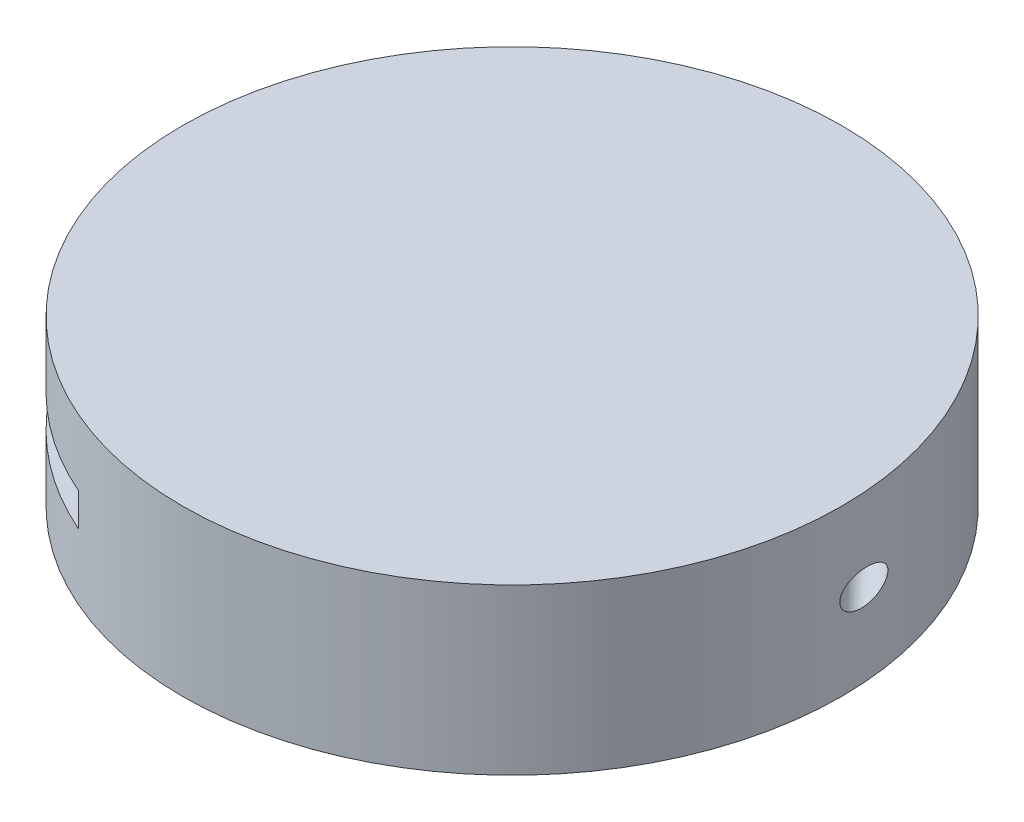
ISO-10303-21;
HEADER;
FILE_DESCRIPTION(('STEP AP214'),'2;1');
FILE_NAME('part.step','',(''),(''),'','','');
FILE_SCHEMA(('AUTOMOTIVE_DESIGN { 1 0 10303 214 1 1 1 1 }'));
ENDSEC;
DATA;
#1=APPLICATION_CONTEXT('core data for automotive mechanical design processes');
#2=APPLICATION_PROTOCOL_DEFINITION('international standard','automotive_design',2000,#1);
#3=PRODUCT_CONTEXT('',#1,'mechanical');
#4=PRODUCT('Part','Part','',(#3));
#5=PRODUCT_RELATED_PRODUCT_CATEGORY('part','',(#4));
#6=PRODUCT_DEFINITION_FORMATION('','',#4);
#7=PRODUCT_DEFINITION_CONTEXT('part definition',#1,'design');
#8=PRODUCT_DEFINITION('design','',#6,#7);
#9=PRODUCT_DEFINITION_SHAPE('','',#8);
#10=(LENGTH_UNIT() NAMED_UNIT(*) SI_UNIT(.MILLI.,.METRE.));
#11=(NAMED_UNIT(*) PLANE_ANGLE_UNIT() SI_UNIT($,.RADIAN.));
#12=(NAMED_UNIT(*) SI_UNIT($,.STERADIAN.) SOLID_ANGLE_UNIT());
#13=UNCERTAINTY_MEASURE_WITH_UNIT(LENGTH_MEASURE(1.E-05),#10,'distance_accuracy_value','');
#14=(GEOMETRIC_REPRESENTATION_CONTEXT(3) GLOBAL_UNCERTAINTY_ASSIGNED_CONTEXT((#13)) GLOBAL_UNIT_ASSIGNED_CONTEXT((#10,
#11,#12)) REPRESENTATION_CONTEXT('',''));
#15=CARTESIAN_POINT('',(0.,0.,0.));
#16=DIRECTION('',(0.,0.,1.));
#17=DIRECTION('',(1.,0.,0.));
#18=AXIS2_PLACEMENT_3D('',#15,#16,#17);
#19=CARTESIAN_POINT('',(-15.4709005410034,5.,-0.196257405736408));
#20=DIRECTION('',(0.192550687717084,0.,0.981287028682066));
#21=DIRECTION('',(0.981287028682066,0.,-0.192550687717084));
#22=AXIS2_PLACEMENT_3D('',#19,#20,#21);
#23=CYLINDRICAL_SURFACE('',#22,0.999999999999999);
#24=CARTESIAN_POINT('',(-15.43239040346,4.,0.));
#25=CARTESIAN_POINT('',(-15.4371712007441,3.99999976745943,0.000464581008555885));
#26=CARTESIAN_POINT('',(-15.4419530530917,4.00003408504249,0.000929265079981866));
#27=CARTESIAN_POINT('',(-15.5030193830045,4.00091272003534,0.00686348908024014));
#28=CARTESIAN_POINT('',(-15.5593633408726,4.00650008853509,0.0123388815193882));
#29=CARTESIAN_POINT('',(-15.6425351841717,4.02191906142388,0.0204214439335472));
#30=CARTESIAN_POINT('',(-15.6700777603542,4.02824737178271,0.0230980212325683));
#31=CARTESIAN_POINT('',(-15.7245614794708,4.04321672765971,0.0283927558199562));
#32=CARTESIAN_POINT('',(-15.7515021371671,4.05185957098412,0.0310108659741761));
#33=CARTESIAN_POINT('',(-15.8309903341894,4.08114326254573,0.0387356151624595));
#34=CARTESIAN_POINT('',(-15.8823464576918,4.10516580329628,0.043726507398875));
#35=CARTESIAN_POINT('',(-15.9802793509286,4.16154045244269,0.0532438932226854));
#36=CARTESIAN_POINT('',(-16.0268560146762,4.19389274549884,0.0577703765115981));
#37=CARTESIAN_POINT('',(-16.1138204931851,4.26594728767302,0.0662219348199739));
#38=CARTESIAN_POINT('',(-16.1542221273768,4.3056326722021,0.0701483527561489));
#39=CARTESIAN_POINT('',(-16.2277874317254,4.39128638254838,0.0772977970786232));
#40=CARTESIAN_POINT('',(-16.2609503478433,4.43725536210146,0.0805207501867697));
#41=CARTESIAN_POINT('',(-16.3189322882183,4.53394479226925,0.0861557654453824));
#42=CARTESIAN_POINT('',(-16.3437885133159,4.58464272171089,0.0885714429130465));
#43=CARTESIAN_POINT('',(-16.384635896769,4.68952257726802,0.0925412428676627));
#44=CARTESIAN_POINT('',(-16.4006274500688,4.74370434804921,0.0940954037374388));
#45=CARTESIAN_POINT('',(-16.4232300988705,4.85377617977086,0.0962920740757935));
#46=CARTESIAN_POINT('',(-16.4298793633608,4.9096583310622,0.09693829304473));
#47=CARTESIAN_POINT('',(-16.4337257772587,5.02174973186135,0.0973121126002295));
#48=CARTESIAN_POINT('',(-16.4309230565466,5.07795897686394,0.0970397258094248));
#49=CARTESIAN_POINT('',(-16.4159624272391,5.1889953743593,0.0955857550410436));
#50=CARTESIAN_POINT('',(-16.4038225230592,5.24382497725919,0.0944059208480979));
#51=CARTESIAN_POINT('',(-16.370562548728,5.35066226202183,0.0911735076909003));
#52=CARTESIAN_POINT('',(-16.3494423613693,5.4026699070434,0.0891209173357431));
#53=CARTESIAN_POINT('',(-16.2988052121054,5.50245423681234,0.0841996997820928));
#54=CARTESIAN_POINT('',(-16.2692787096169,5.55022603291186,0.0813301453862478));
#55=CARTESIAN_POINT('',(-16.2026901340079,5.64013097325074,0.0748587126776974));
#56=CARTESIAN_POINT('',(-16.1656285619606,5.68226449212007,0.0712568830604257));
#57=CARTESIAN_POINT('',(-16.0846939931178,5.76005207971962,0.0633912982848601));
#58=CARTESIAN_POINT('',(-16.0407661704477,5.79564848674675,0.0591222152348444));
#59=CARTESIAN_POINT('',(-15.9475600213478,5.8589354307652,0.050064130483504));
#60=CARTESIAN_POINT('',(-15.8982816372233,5.88662588249546,0.0452751231758722));
#61=CARTESIAN_POINT('',(-15.8214419681962,5.92164871116675,0.0378077016812417));
#62=CARTESIAN_POINT('',(-15.7953104389192,5.93224581827171,0.0352682019119004));
#63=CARTESIAN_POINT('',(-15.7422796601538,5.9511895192091,0.0301146189831382));
#64=CARTESIAN_POINT('',(-15.7153810881158,5.9595380348329,0.0275006016380926));
#65=CARTESIAN_POINT('',(-15.6338661241636,5.98109825960905,0.0195789766937145));
#66=CARTESIAN_POINT('',(-15.5782935849346,5.99088687406204,0.0141784920003707));
#67=CARTESIAN_POINT('',(-15.497214097484,5.99821827940226,0.00629936519228911));
#68=CARTESIAN_POINT('',(-15.4719811140239,5.99953518628247,0.00384729279394997));
#69=CARTESIAN_POINT('',(-15.4419540234149,5.99996565075822,0.000929359402708378));
#70=CARTESIAN_POINT('',(-15.4371722500046,5.99999994080979,0.000464682991696604));
#71=CARTESIAN_POINT('',(-15.43239040346,6.,0.));
#72=B_SPLINE_CURVE_WITH_KNOTS('',3,(#24,#25,#26,#27,#28,#29,#30,#31,#32,#33,#34,#35,#36,#37,#38,
#39,#40,#41,#42,#43,#44,#45,#46,#47,#48,#49,#50,#51,#52,#53,#54,#55,#56,#57,#58,#59,#60,#61,#62,
#63,#64,#65,#66,#67,#68,#69,#70,#71),.UNSPECIFIED.,.F.,.F.,(4,2,2,2,2,2,2,2,2,2,2,2,2,2,2,2,2,2,
2,2,2,2,2,4),(0.,0.0144128743197342,0.184042013393383,0.269127121439187,0.354278511738155,
0.524150482903644,0.694026220244487,0.86351603419933,1.03302349506259,1.20176132645818,
1.37049163953646,1.53853056094815,1.70656717333354,1.87428057910036,2.04199617387053,
2.20990287819946,2.37779842058166,2.54711039008855,2.71642418545598,2.80127369975428,
2.88605046439921,3.05515653494316,3.13125782323678,3.14567069755652),.UNSPECIFIED.);
#73=CARTESIAN_POINT('',(-15.43239040346,4.,0.));
#74=VERTEX_POINT('',#73);
#75=CARTESIAN_POINT('',(-16.4323908498638,5.00000000000001,0.0971823756618541));
#76=VERTEX_POINT('',#75);
#77=EDGE_CURVE('E243',#74,#76,#72,.T.);
#78=ORIENTED_EDGE('',*,*,#77,.T.);
#79=CARTESIAN_POINT('',(-15.4310110303126,5.,0.00702963460319863));
#80=DIRECTION('',(0.0896658743200073,0.,0.995971902707315));
#81=DIRECTION('',(0.995971902707315,0.,-0.0896658743200073));
#82=AXIS2_PLACEMENT_3D('',#79,#80,#81);
#83=ELLIPSE('',#82,1.00542978856048,0.999999999999999);
#84=CARTESIAN_POINT('',(-15.4310110303126,4.,0.00702963460319864));
#85=VERTEX_POINT('',#84);
#86=EDGE_CURVE('E228',#76,#85,#83,.T.);
#87=ORIENTED_EDGE('',*,*,#86,.T.);
#88=CARTESIAN_POINT('',(-15.4310110303126,6.,0.00702963460319863));
#89=VERTEX_POINT('',#88);
#90=EDGE_CURVE('E202',#85,#89,#83,.T.);
#91=ORIENTED_EDGE('',*,*,#90,.T.);
#92=EDGE_CURVE('E229',#89,#76,#83,.T.);
#93=ORIENTED_EDGE('',*,*,#92,.T.);
#94=CARTESIAN_POINT('',(-15.43239040346,6.,0.));
#95=VERTEX_POINT('',#94);
#96=EDGE_CURVE('E254',#76,#95,#72,.T.);
#97=ORIENTED_EDGE('',*,*,#96,.T.);
#98=CARTESIAN_POINT('',(-15.43239040346,4.,0.));
#99=CARTESIAN_POINT('',(-15.4276096061147,3.99999976750804,-0.000464582721420509));
#100=CARTESIAN_POINT('',(-15.422827743262,4.00003408508094,-0.000929158195556335));
#101=CARTESIAN_POINT('',(-15.3617500922791,4.00091287282075,-0.00686167062436035));
#102=CARTESIAN_POINT('',(-15.3053933543818,4.0065022043625,-0.0123203964732372));
#103=CARTESIAN_POINT('',(-15.2222007858327,4.02192573021389,-0.0203570148810716));
#104=CARTESIAN_POINT('',(-15.1946510063862,4.02825583889177,-0.0230147423828403));
#105=CARTESIAN_POINT('',(-15.1401524169916,4.04322918822343,-0.0282653905842816));
#106=CARTESIAN_POINT('',(-15.1132040918189,4.05187422661479,-0.03085825919714));
#107=CARTESIAN_POINT('',(-15.0336927147665,4.08116475605584,-0.0384988382493673));
#108=CARTESIAN_POINT('',(-14.9823204555366,4.10519227782216,-0.0434223114341478));
#109=CARTESIAN_POINT('',(-14.8843542043533,4.16157748262064,-0.0527900731221191));
#110=CARTESIAN_POINT('',(-14.8377603192045,4.19393535179315,-0.0572343509146121));
#111=CARTESIAN_POINT('',(-14.7507570460743,4.26600563477533,-0.0655166942077089));
#112=CARTESIAN_POINT('',(-14.7103344496084,4.30570192741698,-0.0693560550002529));
#113=CARTESIAN_POINT('',(-14.6367306562147,4.39138017983481,-0.0763356831665498));
#114=CARTESIAN_POINT('',(-14.6035502100506,4.43736279048476,-0.0794758780613428));
#115=CARTESIAN_POINT('',(-14.5455430952166,4.53407592188867,-0.0849589642290092));
#116=CARTESIAN_POINT('',(-14.5206781626879,4.58478328293956,-0.0873055080718791));
#117=CARTESIAN_POINT('',(-14.4798198324526,4.68968304176194,-0.0911583461329372));
#118=CARTESIAN_POINT('',(-14.4638260234903,4.74387527784851,-0.0926646793023778));
#119=CARTESIAN_POINT('',(-14.441230319818,4.85395237711171,-0.0947920958039035));
#120=CARTESIAN_POINT('',(-14.4345876029573,4.90982878871705,-0.0954170269156047));
#121=CARTESIAN_POINT('',(-14.4307577732933,5.02190720964705,-0.0957773783296741));
#122=CARTESIAN_POINT('',(-14.4335705152413,5.07810921395693,-0.0955128122959224));
#123=CARTESIAN_POINT('',(-14.4485527137478,5.18911978349665,-0.0941027417002622));
#124=CARTESIAN_POINT('',(-14.4607025610174,5.24393102064518,-0.0929590833598432));
#125=CARTESIAN_POINT('',(-14.493980698117,5.35073127769725,-0.0898233707072041));
#126=CARTESIAN_POINT('',(-14.5151091381321,5.40272025037634,-0.0878313022036215));
#127=CARTESIAN_POINT('',(-14.5657620810265,5.50247368162734,-0.0830486368131935));
#128=CARTESIAN_POINT('',(-14.5952970431286,5.55023277980756,-0.0802570451488665));
#129=CARTESIAN_POINT('',(-14.6618988420042,5.64011347583385,-0.0739505377414435));
#130=CARTESIAN_POINT('',(-14.6989650572361,5.6822355384195,-0.0704356816878383));
#131=CARTESIAN_POINT('',(-14.77972345744,5.75983036053947,-0.0627613922224341));
#132=CARTESIAN_POINT('',(-14.8234413264671,5.79527609909889,-0.0585994588245836));
#133=CARTESIAN_POINT('',(-14.9161814426384,5.85834183566145,-0.0497495056553639));
#134=CARTESIAN_POINT('',(-14.9652037779223,5.88596170360135,-0.0450614771422861));
#135=CARTESIAN_POINT('',(-15.0418573928546,5.92104466649547,-0.0377121980987739));
#136=CARTESIAN_POINT('',(-15.0680756268057,5.93172047293598,-0.0351954057411032));
#137=CARTESIAN_POINT('',(-15.1212880723444,5.95080613501979,-0.0300806678416154));
#138=CARTESIAN_POINT('',(-15.1482816070414,5.95921790453441,-0.0274827929283725));
#139=CARTESIAN_POINT('',(-15.2300906805132,5.98094300911362,-0.0195987953979723));
#140=CARTESIAN_POINT('',(-15.2858722186678,5.99080891361981,-0.0142091202507948));
#141=CARTESIAN_POINT('',(-15.3672974812437,5.99820425910146,-0.006319807883591));
#142=CARTESIAN_POINT('',(-15.3926651551283,5.99953326378799,-0.0038588788712697));
#143=CARTESIAN_POINT('',(-15.4228267739908,5.9999656505265,-0.000929250697832288));
#144=CARTESIAN_POINT('',(-15.4276085580882,5.99999994058257,-0.000464682685202067));
#145=CARTESIAN_POINT('',(-15.43239040346,6.,0.));
#146=B_SPLINE_CURVE_WITH_KNOTS('',3,(#98,#99,#100,#101,#102,#103,#104,#105,#106,#107,#108,#109,
#110,#111,#112,#113,#114,#115,#116,#117,#118,#119,#120,#121,#122,#123,#124,#125,#126,#127,#128,
#129,#130,#131,#132,#133,#134,#135,#136,#137,#138,#139,#140,#141,#142,#143,#144,#145),
.UNSPECIFIED.,.F.,.F.,(4,2,2,2,2,2,2,2,2,2,2,2,2,2,2,2,2,2,2,2,2,2,2,4),(0.,0.0144128743201625,
0.184075323980339,0.269177286883756,0.354345531253008,0.524249885037985,0.694158035639746,
0.863697271641482,1.03325407473597,1.20201956721872,1.37077723526651,1.53879588339746,
1.70681195054638,1.87447612040329,2.04214309489008,2.2100195959649,2.3778822480972,
2.54641033809832,2.71494122881285,2.80011195855081,2.88521046267395,3.05495772009452,
3.13146411288532,3.14587698720548),.UNSPECIFIED.);
#147=EDGE_CURVE('E242',#74,#95,#146,.T.);
#148=ORIENTED_EDGE('',*,*,#147,.F.);
#149=EDGE_LOOP('',(#78,#87,#91,#93,#97,#148));
#150=FACE_BOUND('',#149,.T.);
#151=ADVANCED_FACE('F72',(#150),#23,.F.);
#152=CARTESIAN_POINT('',(0.,10.,0.));
#153=DIRECTION('',(0.,-1.,0.));
#154=DIRECTION('',(0.,0.,-1.));
#155=AXIS2_PLACEMENT_3D('',#152,#153,#154);
#156=CYLINDRICAL_SURFACE('',#155,20.);
#157=CARTESIAN_POINT('',(0.,10.,0.));
#158=DIRECTION('',(0.,1.,0.));
#159=DIRECTION('',(0.,0.,1.));
#160=AXIS2_PLACEMENT_3D('',#157,#158,#159);
#161=CIRCLE('',#160,20.);
#162=CARTESIAN_POINT('',(0.,10.,20.));
#163=VERTEX_POINT('',#162);
#164=EDGE_CURVE('E354',#163,#163,#161,.T.);
#165=ORIENTED_EDGE('',*,*,#164,.F.);
#166=EDGE_LOOP('',(#165));
#167=FACE_BOUND('',#166,.T.);
#168=CARTESIAN_POINT('',(0.,0.,0.));
#169=DIRECTION('',(0.,1.,0.));
#170=DIRECTION('',(0.,0.,1.));
#171=AXIS2_PLACEMENT_3D('',#168,#169,#170);
#172=CIRCLE('',#171,20.);
#173=CARTESIAN_POINT('',(0.,0.,20.));
#174=VERTEX_POINT('',#173);
#175=EDGE_CURVE('E320',#174,#174,#172,.T.);
#176=ORIENTED_EDGE('',*,*,#175,.T.);
#177=EDGE_LOOP('',(#176));
#178=FACE_BOUND('',#177,.T.);
#179=CARTESIAN_POINT('',(19.9996644608909,5.,0.115850989546034));
#180=CARTESIAN_POINT('',(19.9996646705487,4.95624578744699,0.115845398326166));
#181=CARTESIAN_POINT('',(19.9996900619536,4.91244669692464,0.111664936008385));
#182=CARTESIAN_POINT('',(19.9997745792665,4.82635211257632,0.0952856549789294));
#183=CARTESIAN_POINT('',(19.9998337597725,4.78405917023907,0.0830738540192422));
#184=CARTESIAN_POINT('',(19.999939224392,4.70251258393055,0.0516899343315177));
#185=CARTESIAN_POINT('',(19.9999855946617,4.66323998466413,0.0325664165329392));
#186=CARTESIAN_POINT('',(20.0000088398909,4.58812871715236,-0.0114657464477621));
#187=CARTESIAN_POINT('',(19.9999856940858,4.55229107824059,-0.0363761181322695));
#188=CARTESIAN_POINT('',(19.9997763529892,4.47039045868836,-0.102019869546405));
#189=CARTESIAN_POINT('',(19.9995271126287,4.42617079230401,-0.145050505182721));
#190=CARTESIAN_POINT('',(19.9986424897453,4.34517117453742,-0.237609300172354));
#191=CARTESIAN_POINT('',(19.998006277234,4.308407441473,-0.287151245618692));
#192=CARTESIAN_POINT('',(19.9958632447147,4.22726161139211,-0.413487088567999));
#193=CARTESIAN_POINT('',(19.9940965952727,4.18663955434515,-0.492684051113804));
#194=CARTESIAN_POINT('',(19.9893967166805,4.1182494096185,-0.65634283619259));
#195=CARTESIAN_POINT('',(19.9864615184665,4.09050319015607,-0.740813341294598));
#196=CARTESIAN_POINT('',(19.9778652199971,4.03715119930383,-0.948515488313875));
#197=CARTESIAN_POINT('',(19.9715775945653,4.01728320607264,-1.07319636918882));
#198=CARTESIAN_POINT('',(19.9565262960417,3.99750286767381,-1.32399367177359));
#199=CARTESIAN_POINT('',(19.9477580284217,3.99762779720981,-1.4501123365327));
#200=CARTESIAN_POINT('',(19.9277019718537,4.01680072551759,-1.70388450767642));
#201=CARTESIAN_POINT('',(19.9163582731017,4.03630724352188,-1.83150113894347));
#202=CARTESIAN_POINT('',(19.8979250314423,4.08048240631837,-2.01904820562964));
#203=CARTESIAN_POINT('',(19.8915485543891,4.0976786846091,-2.08088190448146));
#204=CARTESIAN_POINT('',(19.8784164580438,4.13730458689188,-2.20279442860969));
#205=CARTESIAN_POINT('',(19.8716610706485,4.15973103594552,-2.2628742937417));
#206=CARTESIAN_POINT('',(19.8571081718711,4.21313124917619,-2.38738815181034));
#207=CARTESIAN_POINT('',(19.8492801818352,4.24479153426752,-2.45152783970282));
#208=CARTESIAN_POINT('',(19.8335977220436,4.3160074715358,-2.57532020801769));
#209=CARTESIAN_POINT('',(19.825743278173,4.35555685013574,-2.63497640224142));
#210=CARTESIAN_POINT('',(19.812361956193,4.4329584845944,-2.7335242536093));
#211=CARTESIAN_POINT('',(19.8067359269927,4.4688567772813,-2.77392436488973));
#212=CARTESIAN_POINT('',(19.796090993209,4.5464123804146,-2.84889521026055));
#213=CARTESIAN_POINT('',(19.7910708988696,4.58805804931467,-2.88347742222063));
#214=CARTESIAN_POINT('',(19.7834962110125,4.66377218872632,-2.93491742149147));
#215=CARTESIAN_POINT('',(19.7806555672969,4.69630983908814,-2.95397015282145));
#216=CARTESIAN_POINT('',(19.7757344570236,4.76404470576512,-2.98673756972343));
#217=CARTESIAN_POINT('',(19.7736532581912,4.79923932043304,-3.00045739824299));
#218=CARTESIAN_POINT('',(19.7704548302344,4.87197423574513,-3.02146219452844));
#219=CARTESIAN_POINT('',(19.7693475048168,4.90953456491779,-3.02868106881009));
#220=CARTESIAN_POINT('',(19.7682876958478,4.985354389835,-3.03559157804389));
#221=CARTESIAN_POINT('',(19.7683343180595,5.02361332123176,-3.03528904161601));
#222=CARTESIAN_POINT('',(19.7694844928636,5.09399791447014,-3.02778652198489));
#223=CARTESIAN_POINT('',(19.7704398400751,5.12623524818776,-3.02155368241418));
#224=CARTESIAN_POINT('',(19.7730975285965,5.18929299549577,-3.00411245275609));
#225=CARTESIAN_POINT('',(19.7748002773594,5.22011262607257,-2.99290134868122));
#226=CARTESIAN_POINT('',(19.7795531655906,5.29084150634102,-2.96135310521202));
#227=CARTESIAN_POINT('',(19.7828686486158,5.32990773699367,-2.93917493296717));
#228=CARTESIAN_POINT('',(19.7902678599003,5.40396189485639,-2.88893512893));
#229=CARTESIAN_POINT('',(19.7943532867187,5.43894052267949,-2.86086047303345));
#230=CARTESIAN_POINT('',(19.8053341689059,5.52280435437419,-2.78404989146583));
#231=CARTESIAN_POINT('',(19.8125512048919,5.56893214051861,-2.7323707526863));
#232=CARTESIAN_POINT('',(19.8273690062606,5.65282117287748,-2.62269467796434));
#233=CARTESIAN_POINT('',(19.8349706640658,5.69056175253802,-2.56468265010959));
#234=CARTESIAN_POINT('',(19.8487141902931,5.75231931076964,-2.4558036191253));
#235=CARTESIAN_POINT('',(19.8548629449723,5.77758277408469,-2.40563197939592));
#236=CARTESIAN_POINT('',(19.8669981230555,5.82370202355268,-2.30326951696597));
#237=CARTESIAN_POINT('',(19.8729844456912,5.84455512577737,-2.25107748747769));
#238=CARTESIAN_POINT('',(19.8905479425106,5.90100025663272,-2.09222595848241));
#239=CARTESIAN_POINT('',(19.901727280091,5.93046811419358,-1.98330952157933));
#240=CARTESIAN_POINT('',(19.923025703084,5.97539466194865,-1.75688897131287));
#241=CARTESIAN_POINT('',(19.9330634122015,5.9900759930088,-1.63922820806925));
#242=CARTESIAN_POINT('',(19.9510910910457,6.00276184542339,-1.40284667436342));
#243=CARTESIAN_POINT('',(19.9590819684691,6.00077377230255,-1.2841263980132));
#244=CARTESIAN_POINT('',(19.9720348481954,5.98019108245131,-1.06238262511154));
#245=CARTESIAN_POINT('',(19.9772454612684,5.96362118032924,-0.959187563960428));
#246=CARTESIAN_POINT('',(19.9859472338722,5.91494124519335,-0.756396833726596));
#247=CARTESIAN_POINT('',(19.9894409627959,5.88285457737765,-0.656795994005584));
#248=CARTESIAN_POINT('',(19.9939468676832,5.81413944143401,-0.496300198689361));
#249=CARTESIAN_POINT('',(19.9953964698879,5.78236980808458,-0.433339608570352));
#250=CARTESIAN_POINT('',(19.9976437952689,5.70979320460786,-0.312804098092703));
#251=CARTESIAN_POINT('',(19.9984424717246,5.66899956192926,-0.255221411710221));
#252=CARTESIAN_POINT('',(19.9993873803673,5.58908482548944,-0.161642657670373));
#253=CARTESIAN_POINT('',(19.9996466604682,5.5520844387044,-0.123844727453055));
#254=CARTESIAN_POINT('',(19.9999554551967,5.4725316543949,-0.0545665896010706));
#255=CARTESIAN_POINT('',(20.0000052019224,5.42998545382505,-0.0230794284406374));
#256=CARTESIAN_POINT('',(19.9999949685167,5.3483485198702,0.026390271597036));
#257=CARTESIAN_POINT('',(19.9999539592719,5.31012581773583,0.0458005985355958));
#258=CARTESIAN_POINT('',(19.9998544731755,5.2310091513577,0.0779952372614128));
#259=CARTESIAN_POINT('',(19.9997960321781,5.19012080348601,0.0907930037032842));
#260=CARTESIAN_POINT('',(19.9997243462182,5.12407905793943,0.105130389457675));
#261=CARTESIAN_POINT('',(19.9997024107147,5.09944210374355,0.109138199212017));
#262=CARTESIAN_POINT('',(19.9996724065965,5.04987500854986,0.1145004165105));
#263=CARTESIAN_POINT('',(19.9996643413624,5.02494479756396,0.115854177167057));
#264=CARTESIAN_POINT('',(19.9996644608909,5.,0.115850989546034));
#265=B_SPLINE_CURVE_WITH_KNOTS('',3,(#179,#180,#181,#182,#183,#184,#185,#186,#187,#188,#189,
#190,#191,#192,#193,#194,#195,#196,#197,#198,#199,#200,#201,#202,#203,#204,#205,#206,#207,#208,
#209,#210,#211,#212,#213,#214,#215,#216,#217,#218,#219,#220,#221,#222,#223,#224,#225,#226,#227,
#228,#229,#230,#231,#232,#233,#234,#235,#236,#237,#238,#239,#240,#241,#242,#243,#244,#245,#246,
#247,#248,#249,#250,#251,#252,#253,#254,#255,#256,#257,#258,#259,#260,#261,#262,#263,#264),
.UNSPECIFIED.,.T.,.F.,(4,2,2,2,2,2,2,2,2,2,2,2,2,2,2,2,2,2,2,2,2,2,2,2,2,2,2,2,2,2,2,2,2,2,2,2,
2,2,2,2,2,2,4),(0.,0.131150342454578,0.262513205510521,0.39296978766387,0.523465341515471,
0.707541604980935,0.892014079340261,1.1576146124512,1.42366460311315,1.80087244986666,
2.17878356919095,2.56585320517482,2.75915789141106,2.9523455374391,3.16775942546874,
3.38300268978683,3.54556242521561,3.70779759425913,3.82084553482568,3.93378418206031,
4.04785849207165,4.16184440442894,4.25994458982345,4.35809832202607,4.4924755017704,
4.62715267434151,4.83493311832078,5.04322000413059,5.21251633082522,5.38191538834621,
5.7207762720928,6.0766447518937,6.43235514247216,6.74531155292242,7.05779817304908,
7.26880546605547,7.47950318121481,7.63764768073251,7.7956169588768,7.92371351400629,
8.05154839289079,8.1263005472147,8.20107091907342),.UNSPECIFIED.);
#266=CARTESIAN_POINT('',(19.9996644608909,5.,0.115850989546034));
#267=VERTEX_POINT('',#266);
#268=EDGE_CURVE('E253',#267,#267,#265,.T.);
#269=ORIENTED_EDGE('',*,*,#268,.F.);
#270=EDGE_LOOP('',(#269));
#271=FACE_BOUND('',#270,.T.);
#272=DIRECTION('',(0.,-1.,0.));
#273=VECTOR('',#272,1.);
#274=CARTESIAN_POINT('',(-17.1199168011331,10.,10.3396541877512));
#275=LINE('',#274,#273);
#276=CARTESIAN_POINT('',(-17.1199168011331,6.,10.3396541877512));
#277=VERTEX_POINT('',#276);
#278=CARTESIAN_POINT('',(-17.1199168011331,4.,10.3396541877512));
#279=VERTEX_POINT('',#278);
#280=EDGE_CURVE('E230',#277,#279,#275,.T.);
#281=ORIENTED_EDGE('',*,*,#280,.F.);
#282=CARTESIAN_POINT('',(0.,6.,0.));
#283=DIRECTION('',(0.,1.,0.));
#284=DIRECTION('',(0.,0.,1.));
#285=AXIS2_PLACEMENT_3D('',#282,#283,#284);
#286=CIRCLE('',#285,20.);
#287=CARTESIAN_POINT('',(-7.96790416164542,6.,18.3442771258732));
#288=VERTEX_POINT('',#287);
#289=EDGE_CURVE('E235',#277,#288,#286,.T.);
#290=ORIENTED_EDGE('',*,*,#289,.T.);
#291=DIRECTION('',(0.,-1.,0.));
#292=VECTOR('',#291,1.);
#293=CARTESIAN_POINT('',(-7.96790416164543,10.,18.3442771258732));
#294=LINE('',#293,#292);
#295=CARTESIAN_POINT('',(-7.96790416164542,4.,18.3442771258732));
#296=VERTEX_POINT('',#295);
#297=EDGE_CURVE('E12',#296,#288,#294,.F.);
#298=ORIENTED_EDGE('',*,*,#297,.F.);
#299=CARTESIAN_POINT('',(0.,4.,0.));
#300=DIRECTION('',(0.,1.,0.));
#301=DIRECTION('',(0.,0.,1.));
#302=AXIS2_PLACEMENT_3D('',#299,#300,#301);
#303=CIRCLE('',#302,20.);
#304=EDGE_CURVE('E190',#279,#296,#303,.T.);
#305=ORIENTED_EDGE('',*,*,#304,.F.);
#306=EDGE_LOOP('',(#281,#290,#298,#305));
#307=FACE_BOUND('',#306,.T.);
#308=ADVANCED_FACE('F74',(#167,#178,#271,#307),#156,.T.);
#309=CARTESIAN_POINT('',(0.,0.,0.));
#310=DIRECTION('',(0.,1.,0.));
#311=DIRECTION('',(0.,0.,1.));
#312=AXIS2_PLACEMENT_3D('',#309,#310,#311);
#313=PLANE('',#312);
#314=ORIENTED_EDGE('',*,*,#175,.F.);
#315=EDGE_LOOP('',(#314));
#316=FACE_BOUND('',#315,.T.);
#317=DIRECTION('',(0.,0.,-1.));
#318=VECTOR('',#317,1.);
#319=CARTESIAN_POINT('',(2.15,0.,0.));
#320=LINE('',#319,#318);
#321=CARTESIAN_POINT('',(2.15,0.,1.5166375719581));
#322=VERTEX_POINT('',#321);
#323=CARTESIAN_POINT('',(2.15,0.,-4.08568408769113));
#324=VERTEX_POINT('',#323);
#325=EDGE_CURVE('E324',#322,#324,#320,.T.);
#326=ORIENTED_EDGE('',*,*,#325,.T.);
#327=CARTESIAN_POINT('',(0.,0.,-4.08568408769113));
#328=DIRECTION('',(0.,-1.,0.));
#329=DIRECTION('',(0.,0.,-1.));
#330=AXIS2_PLACEMENT_3D('',#327,#328,#329);
#331=CIRCLE('',#330,2.15);
#332=CARTESIAN_POINT('',(-2.15,0.,-4.08568408769113));
#333=VERTEX_POINT('',#332);
#334=EDGE_CURVE('E327',#333,#324,#331,.T.);
#335=ORIENTED_EDGE('',*,*,#334,.F.);
#336=DIRECTION('',(0.,0.,-1.));
#337=VECTOR('',#336,1.);
#338=CARTESIAN_POINT('',(-2.15,0.,0.));
#339=LINE('',#338,#337);
#340=CARTESIAN_POINT('',(-2.15,0.,1.5166375719581));
#341=VERTEX_POINT('',#340);
#342=EDGE_CURVE('E336',#341,#333,#339,.T.);
#343=ORIENTED_EDGE('',*,*,#342,.F.);
#344=CARTESIAN_POINT('',(0.,0.,4.08568408769113));
#345=DIRECTION('',(0.,-1.,0.));
#346=DIRECTION('',(0.,0.,-1.));
#347=AXIS2_PLACEMENT_3D('',#344,#345,#346);
#348=CIRCLE('',#347,3.35);
#349=EDGE_CURVE('E328',#322,#341,#348,.T.);
#350=ORIENTED_EDGE('',*,*,#349,.F.);
#351=EDGE_LOOP('',(#326,#335,#343,#350));
#352=FACE_BOUND('',#351,.T.);
#353=ADVANCED_FACE('F309',(#316,#352),#313,.F.);
#354=CARTESIAN_POINT('',(0.,10.,0.));
#355=DIRECTION('',(0.,1.,0.));
#356=DIRECTION('',(0.,0.,1.));
#357=AXIS2_PLACEMENT_3D('',#354,#355,#356);
#358=PLANE('',#357);
#359=ORIENTED_EDGE('',*,*,#164,.T.);
#360=EDGE_LOOP('',(#359));
#361=FACE_BOUND('',#360,.T.);
#362=ADVANCED_FACE('F298',(#361),#358,.T.);
#363=CARTESIAN_POINT('',(2.15,6.,0.));
#364=DIRECTION('',(-1.,0.,0.));
#365=DIRECTION('',(0.,0.,1.));
#366=AXIS2_PLACEMENT_3D('',#363,#364,#365);
#367=PLANE('',#366);
#368=DIRECTION('',(0.,0.,1.));
#369=VECTOR('',#368,1.);
#370=CARTESIAN_POINT('',(2.15,2.,0.));
#371=LINE('',#370,#369);
#372=CARTESIAN_POINT('',(2.15,2.,-4.08568408769113));
#373=VERTEX_POINT('',#372);
#374=CARTESIAN_POINT('',(2.15,2.,1.5166375719581));
#375=VERTEX_POINT('',#374);
#376=EDGE_CURVE('E348',#373,#375,#371,.T.);
#377=ORIENTED_EDGE('',*,*,#376,.F.);
#378=DIRECTION('',(0.,-1.,0.));
#379=VECTOR('',#378,1.);
#380=CARTESIAN_POINT('',(2.15,6.,-4.08568408769113));
#381=LINE('',#380,#379);
#382=EDGE_CURVE('E334',#373,#324,#381,.T.);
#383=ORIENTED_EDGE('',*,*,#382,.T.);
#384=ORIENTED_EDGE('',*,*,#325,.F.);
#385=DIRECTION('',(0.,-1.,0.));
#386=VECTOR('',#385,1.);
#387=CARTESIAN_POINT('',(2.15,6.,1.5166375719581));
#388=LINE('',#387,#386);
#389=EDGE_CURVE('E97',#375,#322,#388,.T.);
#390=ORIENTED_EDGE('',*,*,#389,.F.);
#391=EDGE_LOOP('',(#377,#383,#384,#390));
#392=FACE_BOUND('',#391,.T.);
#393=ADVANCED_FACE('F294',(#392),#367,.T.);
#394=CARTESIAN_POINT('',(0.,6.,-4.08568408769113));
#395=DIRECTION('',(0.,-1.,0.));
#396=DIRECTION('',(0.,0.,-1.));
#397=AXIS2_PLACEMENT_3D('',#394,#395,#396);
#398=CYLINDRICAL_SURFACE('',#397,2.15);
#399=ORIENTED_EDGE('',*,*,#382,.F.);
#400=CARTESIAN_POINT('',(0.,2.,-4.08568408769113));
#401=DIRECTION('',(0.,-1.,0.));
#402=DIRECTION('',(0.,0.,-1.));
#403=AXIS2_PLACEMENT_3D('',#400,#401,#402);
#404=CIRCLE('',#403,2.15);
#405=CARTESIAN_POINT('',(-2.15,2.,-4.08568408769113));
#406=VERTEX_POINT('',#405);
#407=EDGE_CURVE('E592',#373,#406,#404,.F.);
#408=ORIENTED_EDGE('',*,*,#407,.T.);
#409=DIRECTION('',(0.,-1.,0.));
#410=VECTOR('',#409,1.);
#411=CARTESIAN_POINT('',(-2.15,6.,-4.08568408769113));
#412=LINE('',#411,#410);
#413=EDGE_CURVE('E330',#406,#333,#412,.T.);
#414=ORIENTED_EDGE('',*,*,#413,.T.);
#415=ORIENTED_EDGE('',*,*,#334,.T.);
#416=EDGE_LOOP('',(#399,#408,#414,#415));
#417=FACE_BOUND('',#416,.T.);
#418=ADVANCED_FACE('F297',(#417),#398,.F.);
#419=CARTESIAN_POINT('',(-2.15,6.,0.));
#420=DIRECTION('',(-1.,0.,0.));
#421=DIRECTION('',(0.,0.,1.));
#422=AXIS2_PLACEMENT_3D('',#419,#420,#421);
#423=PLANE('',#422);
#424=ORIENTED_EDGE('',*,*,#413,.F.);
#425=DIRECTION('',(0.,0.,1.));
#426=VECTOR('',#425,1.);
#427=CARTESIAN_POINT('',(-2.15,2.,0.));
#428=LINE('',#427,#426);
#429=CARTESIAN_POINT('',(-2.15,2.,1.5166375719581));
#430=VERTEX_POINT('',#429);
#431=EDGE_CURVE('E588',#406,#430,#428,.T.);
#432=ORIENTED_EDGE('',*,*,#431,.T.);
#433=DIRECTION('',(0.,-1.,0.));
#434=VECTOR('',#433,1.);
#435=CARTESIAN_POINT('',(-2.15,6.,1.5166375719581));
#436=LINE('',#435,#434);
#437=EDGE_CURVE('E351',#430,#341,#436,.T.);
#438=ORIENTED_EDGE('',*,*,#437,.T.);
#439=ORIENTED_EDGE('',*,*,#342,.T.);
#440=EDGE_LOOP('',(#424,#432,#438,#439));
#441=FACE_BOUND('',#440,.T.);
#442=ADVANCED_FACE('F292',(#441),#423,.F.);
#443=CARTESIAN_POINT('',(0.,6.,0.));
#444=DIRECTION('',(0.,-1.,0.));
#445=DIRECTION('',(0.,0.,-1.));
#446=AXIS2_PLACEMENT_3D('',#443,#444,#445);
#447=PLANE('',#446);
#448=DIRECTION('',(0.,0.,1.));
#449=VECTOR('',#448,1.);
#450=CARTESIAN_POINT('',(3.35,6.,-4.08568408769113));
#451=LINE('',#450,#449);
#452=CARTESIAN_POINT('',(3.35,6.,-4.08568408769113));
#453=VERTEX_POINT('',#452);
#454=CARTESIAN_POINT('',(3.35,6.,4.08568408769113));
#455=VERTEX_POINT('',#454);
#456=EDGE_CURVE('E556',#453,#455,#451,.T.);
#457=ORIENTED_EDGE('',*,*,#456,.T.);
#458=CARTESIAN_POINT('',(0.,6.,4.08568408769113));
#459=DIRECTION('',(0.,-1.,0.));
#460=DIRECTION('',(0.,0.,-1.));
#461=AXIS2_PLACEMENT_3D('',#458,#459,#460);
#462=CIRCLE('',#461,3.35);
#463=CARTESIAN_POINT('',(-3.35,6.,4.08568408769113));
#464=VERTEX_POINT('',#463);
#465=EDGE_CURVE('E342',#455,#464,#462,.T.);
#466=ORIENTED_EDGE('',*,*,#465,.T.);
#467=DIRECTION('',(0.,0.,-1.));
#468=VECTOR('',#467,1.);
#469=CARTESIAN_POINT('',(-3.35,6.,-4.08568408769113));
#470=LINE('',#469,#468);
#471=CARTESIAN_POINT('',(-3.35,6.,-4.08568408769113));
#472=VERTEX_POINT('',#471);
#473=EDGE_CURVE('E559',#464,#472,#470,.T.);
#474=ORIENTED_EDGE('',*,*,#473,.T.);
#475=CARTESIAN_POINT('',(0.,6.,-4.08568408769113));
#476=DIRECTION('',(0.,-1.,0.));
#477=DIRECTION('',(0.,0.,-1.));
#478=AXIS2_PLACEMENT_3D('',#475,#476,#477);
#479=CIRCLE('',#478,3.35);
#480=EDGE_CURVE('E368',#472,#453,#479,.T.);
#481=ORIENTED_EDGE('',*,*,#480,.T.);
#482=EDGE_LOOP('',(#457,#466,#474,#481));
#483=FACE_BOUND('',#482,.T.);
#484=ADVANCED_FACE('F289',(#483),#447,.T.);
#485=CARTESIAN_POINT('',(0.,6.,4.08568408769113));
#486=DIRECTION('',(0.,-1.,0.));
#487=DIRECTION('',(0.,0.,-1.));
#488=AXIS2_PLACEMENT_3D('',#485,#486,#487);
#489=CYLINDRICAL_SURFACE('',#488,3.35);
#490=CARTESIAN_POINT('',(0.,2.,4.08568408769113));
#491=DIRECTION('',(0.,-1.,0.));
#492=DIRECTION('',(0.,0.,-1.));
#493=AXIS2_PLACEMENT_3D('',#490,#491,#492);
#494=CIRCLE('',#493,3.35);
#495=CARTESIAN_POINT('',(-3.35,2.,4.08568408769113));
#496=VERTEX_POINT('',#495);
#497=EDGE_CURVE('E358',#430,#496,#494,.F.);
#498=ORIENTED_EDGE('',*,*,#497,.T.);
#499=DIRECTION('',(0.,1.,0.));
#500=VECTOR('',#499,1.);
#501=CARTESIAN_POINT('',(-3.35,2.,4.08568408769113));
#502=LINE('',#501,#500);
#503=EDGE_CURVE('E576',#496,#464,#502,.T.);
#504=ORIENTED_EDGE('',*,*,#503,.T.);
#505=ORIENTED_EDGE('',*,*,#465,.F.);
#506=DIRECTION('',(0.,1.,0.));
#507=VECTOR('',#506,1.);
#508=CARTESIAN_POINT('',(3.35,2.,4.08568408769113));
#509=LINE('',#508,#507);
#510=CARTESIAN_POINT('',(3.35,2.,4.08568408769113));
#511=VERTEX_POINT('',#510);
#512=EDGE_CURVE('E580',#511,#455,#509,.T.);
#513=ORIENTED_EDGE('',*,*,#512,.F.);
#514=EDGE_CURVE('E82',#511,#375,#494,.F.);
#515=ORIENTED_EDGE('',*,*,#514,.T.);
#516=ORIENTED_EDGE('',*,*,#389,.T.);
#517=ORIENTED_EDGE('',*,*,#349,.T.);
#518=ORIENTED_EDGE('',*,*,#437,.F.);
#519=EDGE_LOOP('',(#498,#504,#505,#513,#515,#516,#517,#518));
#520=FACE_BOUND('',#519,.T.);
#521=ADVANCED_FACE('F275',(#520),#489,.F.);
#522=CARTESIAN_POINT('',(0.,2.,-4.08568408769113));
#523=DIRECTION('',(0.,-1.,0.));
#524=DIRECTION('',(0.,0.,-1.));
#525=AXIS2_PLACEMENT_3D('',#522,#523,#524);
#526=PLANE('',#525);
#527=DIRECTION('',(0.,0.,1.));
#528=VECTOR('',#527,1.);
#529=CARTESIAN_POINT('',(3.35,2.,-4.08568408769113));
#530=LINE('',#529,#528);
#531=CARTESIAN_POINT('',(3.35,2.,-4.08568408769113));
#532=VERTEX_POINT('',#531);
#533=EDGE_CURVE('E566',#532,#511,#530,.T.);
#534=ORIENTED_EDGE('',*,*,#533,.F.);
#535=CARTESIAN_POINT('',(0.,2.,-4.08568408769113));
#536=DIRECTION('',(0.,-1.,0.));
#537=DIRECTION('',(0.,0.,-1.));
#538=AXIS2_PLACEMENT_3D('',#535,#536,#537);
#539=CIRCLE('',#538,3.35);
#540=CARTESIAN_POINT('',(-3.35,2.,-4.08568408769113));
#541=VERTEX_POINT('',#540);
#542=EDGE_CURVE('E562',#541,#532,#539,.T.);
#543=ORIENTED_EDGE('',*,*,#542,.F.);
#544=DIRECTION('',(0.,0.,-1.));
#545=VECTOR('',#544,1.);
#546=CARTESIAN_POINT('',(-3.35,2.,-4.08568408769113));
#547=LINE('',#546,#545);
#548=EDGE_CURVE('E569',#496,#541,#547,.T.);
#549=ORIENTED_EDGE('',*,*,#548,.F.);
#550=ORIENTED_EDGE('',*,*,#497,.F.);
#551=ORIENTED_EDGE('',*,*,#431,.F.);
#552=ORIENTED_EDGE('',*,*,#407,.F.);
#553=ORIENTED_EDGE('',*,*,#376,.T.);
#554=ORIENTED_EDGE('',*,*,#514,.F.);
#555=EDGE_LOOP('',(#534,#543,#549,#550,#551,#552,#553,#554));
#556=FACE_BOUND('',#555,.T.);
#557=ADVANCED_FACE('F271',(#556),#526,.F.);
#558=CARTESIAN_POINT('',(0.,2.,-4.08568408769113));
#559=DIRECTION('',(0.,1.,0.));
#560=DIRECTION('',(0.,0.,1.));
#561=AXIS2_PLACEMENT_3D('',#558,#559,#560);
#562=CYLINDRICAL_SURFACE('',#561,3.35);
#563=ORIENTED_EDGE('',*,*,#480,.F.);
#564=DIRECTION('',(0.,1.,0.));
#565=VECTOR('',#564,1.);
#566=CARTESIAN_POINT('',(-3.35,2.,-4.08568408769113));
#567=LINE('',#566,#565);
#568=EDGE_CURVE('E572',#541,#472,#567,.T.);
#569=ORIENTED_EDGE('',*,*,#568,.F.);
#570=ORIENTED_EDGE('',*,*,#542,.T.);
#571=DIRECTION('',(0.,1.,0.));
#572=VECTOR('',#571,1.);
#573=CARTESIAN_POINT('',(3.35,2.,-4.08568408769113));
#574=LINE('',#573,#572);
#575=EDGE_CURVE('E584',#532,#453,#574,.T.);
#576=ORIENTED_EDGE('',*,*,#575,.T.);
#577=EDGE_LOOP('',(#563,#569,#570,#576));
#578=FACE_BOUND('',#577,.T.);
#579=ADVANCED_FACE('F274',(#578),#562,.F.);
#580=CARTESIAN_POINT('',(3.35,2.,-4.08568408769113));
#581=DIRECTION('',(-1.,0.,0.));
#582=DIRECTION('',(0.,0.,1.));
#583=AXIS2_PLACEMENT_3D('',#580,#581,#582);
#584=PLANE('',#583);
#585=ORIENTED_EDGE('',*,*,#456,.F.);
#586=ORIENTED_EDGE('',*,*,#575,.F.);
#587=ORIENTED_EDGE('',*,*,#533,.T.);
#588=ORIENTED_EDGE('',*,*,#512,.T.);
#589=EDGE_LOOP('',(#585,#586,#587,#588));
#590=FACE_BOUND('',#589,.T.);
#591=ADVANCED_FACE('F281',(#590),#584,.T.);
#592=CARTESIAN_POINT('',(-3.35,2.,-4.08568408769113));
#593=DIRECTION('',(1.,0.,0.));
#594=DIRECTION('',(0.,0.,-1.));
#595=AXIS2_PLACEMENT_3D('',#592,#593,#594);
#596=PLANE('',#595);
#597=ORIENTED_EDGE('',*,*,#473,.F.);
#598=ORIENTED_EDGE('',*,*,#503,.F.);
#599=ORIENTED_EDGE('',*,*,#548,.T.);
#600=ORIENTED_EDGE('',*,*,#568,.T.);
#601=EDGE_LOOP('',(#597,#598,#599,#600));
#602=FACE_BOUND('',#601,.T.);
#603=ADVANCED_FACE('F277',(#602),#596,.T.);
#604=CARTESIAN_POINT('',(50.8724650324793,5.,31.2187433023384));
#605=DIRECTION('',(-0.6880982415987,0.,-0.7256175369358));
#606=DIRECTION('',(-0.7256175369358,0.,0.6880982415987));
#607=AXIS2_PLACEMENT_3D('',#604,#605,#606);
#608=CYLINDRICAL_SURFACE('',#607,0.999999999999999);
#609=CARTESIAN_POINT('',(11.1980131135903,5.,-10.6190007002855));
#610=DIRECTION('',(0.6880982415987,0.,0.7256175369358));
#611=DIRECTION('',(0.7256175369358,0.,-0.6880982415987));
#612=AXIS2_PLACEMENT_3D('',#609,#610,#611);
#613=CIRCLE('',#612,0.999999999999999);
#614=CARTESIAN_POINT('',(11.9236306505261,5.,-11.3070989418842));
#615=VERTEX_POINT('',#614);
#616=EDGE_CURVE('E238',#615,#615,#613,.T.);
#617=ORIENTED_EDGE('',*,*,#616,.F.);
#618=EDGE_LOOP('',(#617));
#619=FACE_BOUND('',#618,.T.);
#620=ORIENTED_EDGE('',*,*,#268,.T.);
#621=EDGE_LOOP('',(#620));
#622=FACE_BOUND('',#621,.T.);
#623=ADVANCED_FACE('F280',(#619,#622),#608,.F.);
#624=CARTESIAN_POINT('',(11.9236306505261,5.,-11.3070989418842));
#625=CARTESIAN_POINT('',(9.67848578067433,5.,-13.6746627460596));
#626=CARTESIAN_POINT('',(6.71269586530027,5.,-15.349566692705));
#627=CARTESIAN_POINT('',(0.339033785582667,5.,-16.7497623722109));
#628=CARTESIAN_POINT('',(-3.05569120835315,5.,-16.4721654518497));
#629=CARTESIAN_POINT('',(-9.1172049544848,5.,-14.0551078704707));
#630=CARTESIAN_POINT('',(-11.7714909737107,5.,-11.9206326503321));
#631=CARTESIAN_POINT('',(-14.5175174530028,5.,-7.8693486651144));
#632=CARTESIAN_POINT('',(-15.2297248319933,5.,-6.38283022625424));
#633=CARTESIAN_POINT('',(-15.948016599779,5.,-4.04346600713315));
#634=CARTESIAN_POINT('',(-16.129290068848,5.,-3.24576413936124));
#635=CARTESIAN_POINT('',(-16.3109193474687,5.,-2.03561945424736));
#636=CARTESIAN_POINT('',(-16.3564387583881,5.,-1.62997274564356));
#637=CARTESIAN_POINT('',(-16.4171734753416,5.,-0.816281255888751));
#638=CARTESIAN_POINT('',(-16.4323837901338,5.,-0.395816267210033));
#639=CARTESIAN_POINT('',(-16.4323915534198,5.,0.068826610603157));
#640=CARTESIAN_POINT('',(-16.43239040346,5.,0.133333333333631));
#641=CARTESIAN_POINT('',(-16.43239040346,5.,0.200000000000006));
#642=CARTESIAN_POINT('',(11.9236306505261,7.,-11.3070989418842));
#643=CARTESIAN_POINT('',(9.67848578067433,7.,-13.6746627460596));
#644=CARTESIAN_POINT('',(6.71269586530027,7.,-15.349566692705));
#645=CARTESIAN_POINT('',(0.339033785582669,7.,-16.7497623722109));
#646=CARTESIAN_POINT('',(-3.05569120835315,7.,-16.4721654518497));
#647=CARTESIAN_POINT('',(-9.1172049544848,7.,-14.0551078704707));
#648=CARTESIAN_POINT('',(-11.7714909737107,7.,-11.9206326503321));
#649=CARTESIAN_POINT('',(-14.5175174530028,7.,-7.8693486651144));
#650=CARTESIAN_POINT('',(-15.2297248319933,7.,-6.38283022625424));
#651=CARTESIAN_POINT('',(-15.948016599779,7.,-4.04346600713315));
#652=CARTESIAN_POINT('',(-16.129290068848,7.,-3.24576413936124));
#653=CARTESIAN_POINT('',(-16.3109193474687,7.,-2.03561945424736));
#654=CARTESIAN_POINT('',(-16.3564387583881,7.,-1.62997274564356));
#655=CARTESIAN_POINT('',(-16.4171734753416,7.,-0.816281255888751));
#656=CARTESIAN_POINT('',(-16.4323837901338,7.,-0.395816267210033));
#657=CARTESIAN_POINT('',(-16.4323915534198,7.,0.068826610603157));
#658=CARTESIAN_POINT('',(-16.43239040346,7.,0.133333333333631));
#659=CARTESIAN_POINT('',(-16.43239040346,7.,0.200000000000006));
#660=CARTESIAN_POINT('',(10.4723955766545,7.,-9.93090245868679));
#661=CARTESIAN_POINT('',(8.50050916947642,7.,-12.0103080891523));
#662=CARTESIAN_POINT('',(5.89568802890535,7.,-13.4813580735284));
#663=CARTESIAN_POINT('',(0.297769699543412,7.,-14.7111347640596));
#664=CARTESIAN_POINT('',(-2.6837804718911,7.,-14.4673243973952));
#665=CARTESIAN_POINT('',(-8.00754230278362,7.,-12.344448918804));
#666=CARTESIAN_POINT('',(-10.3387729473471,7.,-10.4697624655923));
#667=CARTESIAN_POINT('',(-12.7505782437225,7.,-6.91156364760076));
#668=CARTESIAN_POINT('',(-13.3761022660721,7.,-5.60597061306915));
#669=CARTESIAN_POINT('',(-14.0069701411399,7.,-3.55133237254346));
#670=CARTESIAN_POINT('',(-14.1661806644551,7.,-2.85071946725894));
#671=CARTESIAN_POINT('',(-14.3257036914389,7.,-1.78786250541031));
#672=CARTESIAN_POINT('',(-14.3656828967275,7.,-1.43158739749019));
#673=CARTESIAN_POINT('',(-14.4190255404093,7.,-0.716930980499766));
#674=CARTESIAN_POINT('',(-14.4323845950473,7.,-0.370972777006924));
#675=CARTESIAN_POINT('',(-14.4323914134573,7.,0.0645066940967316));
#676=CARTESIAN_POINT('',(-14.43239040346,7.,0.133333333333631));
#677=CARTESIAN_POINT('',(-14.43239040346,7.,0.200000000000006));
#678=CARTESIAN_POINT('',(10.4723955766545,5.,-9.93090245868679));
#679=CARTESIAN_POINT('',(8.50050916947642,5.,-12.0103080891523));
#680=CARTESIAN_POINT('',(5.89568802889472,5.,-13.4813580735284));
#681=CARTESIAN_POINT('',(0.297769699554043,5.,-14.7111347640596));
#682=CARTESIAN_POINT('',(-2.6837804718911,5.,-14.4673243973952));
#683=CARTESIAN_POINT('',(-8.00754230278362,5.,-12.344448918804));
#684=CARTESIAN_POINT('',(-10.3387729473471,5.,-10.4697624655923));
#685=CARTESIAN_POINT('',(-12.7505782437225,5.,-6.91156364760076));
#686=CARTESIAN_POINT('',(-13.3761022660721,5.,-5.60597061306915));
#687=CARTESIAN_POINT('',(-14.0069701411399,5.,-3.55133237254346));
#688=CARTESIAN_POINT('',(-14.1661806644551,5.,-2.85071946725894));
#689=CARTESIAN_POINT('',(-14.3257036914389,5.,-1.78786250541031));
#690=CARTESIAN_POINT('',(-14.3656828967275,5.,-1.43158739749019));
#691=CARTESIAN_POINT('',(-14.4190255404093,5.,-0.716930980499766));
#692=CARTESIAN_POINT('',(-14.4323845950473,5.,-0.370972777006924));
#693=CARTESIAN_POINT('',(-14.4323914134573,5.,0.0645066940967316));
#694=CARTESIAN_POINT('',(-14.43239040346,5.,0.133333333333631));
#695=CARTESIAN_POINT('',(-14.43239040346,5.,0.200000000000006));
#696=CARTESIAN_POINT('',(10.4723955766545,3.,-9.93090245868679));
#697=CARTESIAN_POINT('',(8.50050916947642,3.,-12.0103080891523));
#698=CARTESIAN_POINT('',(5.89568802888409,3.,-13.4813580735284));
#699=CARTESIAN_POINT('',(0.297769699564675,3.,-14.7111347640596));
#700=CARTESIAN_POINT('',(-2.6837804718911,3.,-14.4673243973952));
#701=CARTESIAN_POINT('',(-8.00754230278362,3.,-12.344448918804));
#702=CARTESIAN_POINT('',(-10.3387729473471,3.,-10.4697624655923));
#703=CARTESIAN_POINT('',(-12.7505782437225,3.,-6.91156364760076));
#704=CARTESIAN_POINT('',(-13.3761022660721,3.,-5.60597061306915));
#705=CARTESIAN_POINT('',(-14.0069701411399,3.,-3.55133237254346));
#706=CARTESIAN_POINT('',(-14.1661806644551,3.,-2.85071946725894));
#707=CARTESIAN_POINT('',(-14.3257036914389,3.,-1.78786250541031));
#708=CARTESIAN_POINT('',(-14.3656828967275,3.,-1.43158739749019));
#709=CARTESIAN_POINT('',(-14.4190255404093,3.,-0.716930980499766));
#710=CARTESIAN_POINT('',(-14.4323845950473,3.,-0.370972777006924));
#711=CARTESIAN_POINT('',(-14.4323914134573,3.,0.0645066940967316));
#712=CARTESIAN_POINT('',(-14.43239040346,3.,0.133333333333631));
#713=CARTESIAN_POINT('',(-14.43239040346,3.,0.200000000000006));
#714=CARTESIAN_POINT('',(11.9236306505261,3.,-11.3070989418842));
#715=CARTESIAN_POINT('',(9.67848578067433,3.,-13.6746627460596));
#716=CARTESIAN_POINT('',(6.71269586530027,3.,-15.349566692705));
#717=CARTESIAN_POINT('',(0.339033785582669,3.,-16.7497623722109));
#718=CARTESIAN_POINT('',(-3.05569120835315,3.,-16.4721654518497));
#719=CARTESIAN_POINT('',(-9.1172049544848,3.,-14.0551078704707));
#720=CARTESIAN_POINT('',(-11.7714909737107,3.,-11.9206326503321));
#721=CARTESIAN_POINT('',(-14.5175174530028,3.,-7.8693486651144));
#722=CARTESIAN_POINT('',(-15.2297248319933,3.,-6.38283022625424));
#723=CARTESIAN_POINT('',(-15.948016599779,3.,-4.04346600713315));
#724=CARTESIAN_POINT('',(-16.129290068848,3.,-3.24576413936124));
#725=CARTESIAN_POINT('',(-16.3109193474687,3.,-2.03561945424736));
#726=CARTESIAN_POINT('',(-16.3564387583881,3.,-1.62997274564356));
#727=CARTESIAN_POINT('',(-16.4171734753416,3.,-0.816281255888751));
#728=CARTESIAN_POINT('',(-16.4323837901338,3.,-0.395816267210033));
#729=CARTESIAN_POINT('',(-16.4323915534198,3.,0.068826610603157));
#730=CARTESIAN_POINT('',(-16.43239040346,3.,0.133333333333631));
#731=CARTESIAN_POINT('',(-16.43239040346,3.,0.200000000000006));
#732=CARTESIAN_POINT('',(11.9236306505261,5.,-11.3070989418842));
#733=CARTESIAN_POINT('',(9.67848578067433,5.,-13.6746627460596));
#734=CARTESIAN_POINT('',(6.71269586530027,5.,-15.349566692705));
#735=CARTESIAN_POINT('',(0.339033785582667,5.,-16.7497623722109));
#736=CARTESIAN_POINT('',(-3.05569120835315,5.,-16.4721654518497));
#737=CARTESIAN_POINT('',(-9.1172049544848,5.,-14.0551078704707));
#738=CARTESIAN_POINT('',(-11.7714909737107,5.,-11.9206326503321));
#739=CARTESIAN_POINT('',(-14.5175174530028,5.,-7.8693486651144));
#740=CARTESIAN_POINT('',(-15.2297248319933,5.,-6.38283022625424));
#741=CARTESIAN_POINT('',(-15.948016599779,5.,-4.04346600713315));
#742=CARTESIAN_POINT('',(-16.129290068848,5.,-3.24576413936124));
#743=CARTESIAN_POINT('',(-16.3109193474687,5.,-2.03561945424736));
#744=CARTESIAN_POINT('',(-16.3564387583881,5.,-1.62997274564356));
#745=CARTESIAN_POINT('',(-16.4171734753416,5.,-0.816281255888751));
#746=CARTESIAN_POINT('',(-16.4323837901338,5.,-0.395816267210033));
#747=CARTESIAN_POINT('',(-16.4323915534198,5.,0.068826610603157));
#748=CARTESIAN_POINT('',(-16.43239040346,5.,0.133333333333631));
#749=CARTESIAN_POINT('',(-16.43239040346,5.,0.200000000000006));
#750=(BOUNDED_SURFACE() B_SPLINE_SURFACE(3,3,((#624,#625,#626,#627,#628,#629,#630,#631,#632,
#633,#634,#635,#636,#637,#638,#639,#640,#641),(#642,#643,#644,#645,#646,#647,#648,#649,#650,
#651,#652,#653,#654,#655,#656,#657,#658,#659),(#660,#661,#662,#663,#664,#665,#666,#667,#668,
#669,#670,#671,#672,#673,#674,#675,#676,#677),(#678,#679,#680,#681,#682,#683,#684,#685,#686,
#687,#688,#689,#690,#691,#692,#693,#694,#695),(#696,#697,#698,#699,#700,#701,#702,#703,#704,
#705,#706,#707,#708,#709,#710,#711,#712,#713),(#714,#715,#716,#717,#718,#719,#720,#721,#722,
#723,#724,#725,#726,#727,#728,#729,#730,#731),(#732,#733,#734,#735,#736,#737,#738,#739,#740,
#741,#742,#743,#744,#745,#746,#747,#748,#749)),.UNSPECIFIED.,.T.,.F.,
.F.) B_SPLINE_SURFACE_WITH_KNOTS((4,3,4),(4,2,2,2,2,2,2,2,4),(0.,0.5,1.),(0.610595625977076,
0.707946719482807,0.805297812988538,0.902648906494269,0.951324453247135,0.975662226623567,
0.987831113311784,1.,1.00211598990478),
.UNSPECIFIED.) GEOMETRIC_REPRESENTATION_ITEM() RATIONAL_B_SPLINE_SURFACE(((1.,1.,1.,1.,1.,1.,1.,
1.,1.,1.,1.,1.,1.,1.,1.,1.,1.,1.),(0.333333333333333,0.333333333333333,0.333333333333333,
0.333333333333333,0.333333333333333,0.333333333333333,0.333333333333333,0.333333333333333,
0.333333333333333,0.333333333333333,0.333333333333333,0.333333333333333,0.333333333333333,
0.333333333333333,0.333333333333333,0.333333333333333,0.333333333333333,0.333333333333333),
(0.333333333333333,0.333333333333333,0.333333333333333,0.333333333333333,0.333333333333333,
0.333333333333333,0.333333333333333,0.333333333333333,0.333333333333333,0.333333333333333,
0.333333333333333,0.333333333333333,0.333333333333333,0.333333333333333,0.333333333333333,
0.333333333333333,0.333333333333333,0.333333333333333),(1.,1.,1.,1.,1.,1.,1.,1.,1.,1.,1.,1.,1.,
1.,1.,1.,1.,1.),(0.333333333333333,0.333333333333333,0.333333333333333,0.333333333333333,
0.333333333333333,0.333333333333333,0.333333333333333,0.333333333333333,0.333333333333333,
0.333333333333333,0.333333333333333,0.333333333333333,0.333333333333333,0.333333333333333,
0.333333333333333,0.333333333333333,0.333333333333333,0.333333333333333),(0.333333333333333,
0.333333333333333,0.333333333333333,0.333333333333333,0.333333333333333,0.333333333333333,
0.333333333333333,0.333333333333333,0.333333333333333,0.333333333333333,0.333333333333333,
0.333333333333333,0.333333333333333,0.333333333333333,0.333333333333333,0.333333333333333,
0.333333333333333,0.333333333333333),(1.,1.,1.,1.,1.,1.,1.,1.,1.,1.,1.,1.,1.,1.,1.,1.,1.,1.))) REPRESENTATION_ITEM('') SURFACE());
#751=ORIENTED_EDGE('',*,*,#77,.F.);
#752=ORIENTED_EDGE('',*,*,#147,.T.);
#753=ORIENTED_EDGE('',*,*,#96,.F.);
#754=EDGE_LOOP('',(#751,#752,#753));
#755=FACE_BOUND('',#754,.T.);
#756=ORIENTED_EDGE('',*,*,#616,.T.);
#757=EDGE_LOOP('',(#756));
#758=FACE_BOUND('',#757,.T.);
#759=ADVANCED_FACE('F260',(#755,#758),#750,.T.);
#760=CARTESIAN_POINT('',(-14.3944864166724,6.,-0.0862871401809285));
#761=DIRECTION('',(-0.94424294307911,0.,0.329249547372964));
#762=DIRECTION('',(0.329249547372964,0.,0.94424294307911));
#763=AXIS2_PLACEMENT_3D('',#760,#761,#762);
#764=PLANE('',#763);
#765=ORIENTED_EDGE('',*,*,#297,.T.);
#766=DIRECTION('',(-0.329249547372964,0.,-0.94424294307911));
#767=VECTOR('',#766,1.);
#768=CARTESIAN_POINT('',(-14.3944864166724,6.,-0.0862871401809285));
#769=LINE('',#768,#767);
#770=CARTESIAN_POINT('',(-14.3944864166724,6.,-0.0862871401809285));
#771=VERTEX_POINT('',#770);
#772=EDGE_CURVE('E200',#288,#771,#769,.T.);
#773=ORIENTED_EDGE('',*,*,#772,.T.);
#774=DIRECTION('',(0.,-1.,0.));
#775=VECTOR('',#774,1.);
#776=CARTESIAN_POINT('',(-14.3944864166724,6.,-0.0862871401809285));
#777=LINE('',#776,#775);
#778=CARTESIAN_POINT('',(-14.3944864166724,4.,-0.0862871401809285));
#779=VERTEX_POINT('',#778);
#780=EDGE_CURVE('E197',#771,#779,#777,.T.);
#781=ORIENTED_EDGE('',*,*,#780,.T.);
#782=DIRECTION('',(-0.329249547372964,0.,-0.94424294307911));
#783=VECTOR('',#782,1.);
#784=CARTESIAN_POINT('',(-14.3944864166724,4.,-0.0862871401809285));
#785=LINE('',#784,#783);
#786=EDGE_CURVE('E181',#296,#779,#785,.T.);
#787=ORIENTED_EDGE('',*,*,#786,.F.);
#788=EDGE_LOOP('',(#765,#773,#781,#787));
#789=FACE_BOUND('',#788,.T.);
#790=ADVANCED_FACE('F198',(#789),#764,.T.);
#791=CARTESIAN_POINT('',(0.,6.,0.));
#792=DIRECTION('',(0.,1.,0.));
#793=DIRECTION('',(0.,0.,1.));
#794=AXIS2_PLACEMENT_3D('',#791,#792,#793);
#795=PLANE('',#794);
#796=DIRECTION('',(-0.0669742873622973,0.,0.997754701734004));
#797=VECTOR('',#796,1.);
#798=CARTESIAN_POINT('',(-17.7233262266308,6.,19.3289934561797));
#799=LINE('',#798,#797);
#800=CARTESIAN_POINT('',(-16.4323908498638,6.,0.0971823756618541));
#801=VERTEX_POINT('',#800);
#802=EDGE_CURVE('E209',#801,#277,#799,.T.);
#803=ORIENTED_EDGE('',*,*,#802,.F.);
#804=DIRECTION('',(-0.995971902707315,0.,0.0896658743200073));
#805=VECTOR('',#804,1.);
#806=CARTESIAN_POINT('',(-16.4323908498638,6.,0.0971823756618541));
#807=LINE('',#806,#805);
#808=EDGE_CURVE('E219',#89,#801,#807,.T.);
#809=ORIENTED_EDGE('',*,*,#808,.F.);
#810=EDGE_CURVE('E89',#771,#89,#807,.T.);
#811=ORIENTED_EDGE('',*,*,#810,.F.);
#812=ORIENTED_EDGE('',*,*,#772,.F.);
#813=ORIENTED_EDGE('',*,*,#289,.F.);
#814=EDGE_LOOP('',(#803,#809,#811,#812,#813));
#815=FACE_BOUND('',#814,.T.);
#816=ADVANCED_FACE('F380',(#815),#795,.F.);
#817=CARTESIAN_POINT('',(0.,4.,0.));
#818=DIRECTION('',(0.,1.,0.));
#819=DIRECTION('',(0.,0.,1.));
#820=AXIS2_PLACEMENT_3D('',#817,#818,#819);
#821=PLANE('',#820);
#822=ORIENTED_EDGE('',*,*,#304,.T.);
#823=ORIENTED_EDGE('',*,*,#786,.T.);
#824=DIRECTION('',(-0.995971902707315,0.,0.0896658743200073));
#825=VECTOR('',#824,1.);
#826=CARTESIAN_POINT('',(-16.4323908498638,4.,0.0971823756618541));
#827=LINE('',#826,#825);
#828=EDGE_CURVE('E186',#779,#85,#827,.T.);
#829=ORIENTED_EDGE('',*,*,#828,.T.);
#830=CARTESIAN_POINT('',(-16.4323908498638,4.,0.0971823756618541));
#831=VERTEX_POINT('',#830);
#832=EDGE_CURVE('E194',#85,#831,#827,.T.);
#833=ORIENTED_EDGE('',*,*,#832,.T.);
#834=DIRECTION('',(-0.0669742873622973,0.,0.997754701734004));
#835=VECTOR('',#834,1.);
#836=CARTESIAN_POINT('',(-17.7233262266308,4.,19.3289934561797));
#837=LINE('',#836,#835);
#838=EDGE_CURVE('E195',#831,#279,#837,.T.);
#839=ORIENTED_EDGE('',*,*,#838,.T.);
#840=EDGE_LOOP('',(#822,#823,#829,#833,#839));
#841=FACE_BOUND('',#840,.T.);
#842=ADVANCED_FACE('F183',(#841),#821,.T.);
#843=CARTESIAN_POINT('',(-17.7233262266308,6.,19.3289934561797));
#844=DIRECTION('',(0.997754701734004,0.,0.0669742873622973));
#845=DIRECTION('',(0.0669742873622973,0.,-0.997754701734005));
#846=AXIS2_PLACEMENT_3D('',#843,#844,#845);
#847=PLANE('',#846);
#848=ORIENTED_EDGE('',*,*,#280,.T.);
#849=ORIENTED_EDGE('',*,*,#838,.F.);
#850=DIRECTION('',(0.,-1.,0.));
#851=VECTOR('',#850,1.);
#852=CARTESIAN_POINT('',(-16.4323908498638,6.,0.0971823756618541));
#853=LINE('',#852,#851);
#854=EDGE_CURVE('E222',#76,#831,#853,.T.);
#855=ORIENTED_EDGE('',*,*,#854,.F.);
#856=EDGE_CURVE('E203',#801,#76,#853,.T.);
#857=ORIENTED_EDGE('',*,*,#856,.F.);
#858=ORIENTED_EDGE('',*,*,#802,.T.);
#859=EDGE_LOOP('',(#848,#849,#855,#857,#858));
#860=FACE_BOUND('',#859,.T.);
#861=ADVANCED_FACE('F373',(#860),#847,.T.);
#862=CARTESIAN_POINT('',(-16.4323908498638,6.,0.0971823756618541));
#863=DIRECTION('',(0.0896658743200073,0.,0.995971902707315));
#864=DIRECTION('',(0.995971902707315,0.,-0.0896658743200073));
#865=AXIS2_PLACEMENT_3D('',#862,#863,#864);
#866=PLANE('',#865);
#867=ORIENTED_EDGE('',*,*,#808,.T.);
#868=ORIENTED_EDGE('',*,*,#856,.T.);
#869=ORIENTED_EDGE('',*,*,#92,.F.);
#870=EDGE_LOOP('',(#867,#868,#869));
#871=FACE_BOUND('',#870,.T.);
#872=ADVANCED_FACE('F376',(#871),#866,.T.);
#873=ORIENTED_EDGE('',*,*,#854,.T.);
#874=ORIENTED_EDGE('',*,*,#832,.F.);
#875=ORIENTED_EDGE('',*,*,#86,.F.);
#876=EDGE_LOOP('',(#873,#874,#875));
#877=FACE_BOUND('',#876,.T.);
#878=ADVANCED_FACE('F383',(#877),#866,.T.);
#879=ORIENTED_EDGE('',*,*,#828,.F.);
#880=ORIENTED_EDGE('',*,*,#780,.F.);
#881=ORIENTED_EDGE('',*,*,#810,.T.);
#882=ORIENTED_EDGE('',*,*,#90,.F.);
#883=EDGE_LOOP('',(#879,#880,#881,#882));
#884=FACE_BOUND('',#883,.T.);
#885=ADVANCED_FACE('F205',(#884),#866,.T.);
#886=CLOSED_SHELL('',(#151,#308,#353,#362,#393,#418,#442,#484,#521,#557,#579,#591,#603,#623,
#759,#790,#816,#842,#861,#872,#878,#885));
#887=MANIFOLD_SOLID_BREP('B2',#886);
#888=ADVANCED_BREP_SHAPE_REPRESENTATION('',(#18,#887),#14);
#889=SHAPE_DEFINITION_REPRESENTATION(#9,#888);
ENDSEC;
END-ISO-10303-21;
